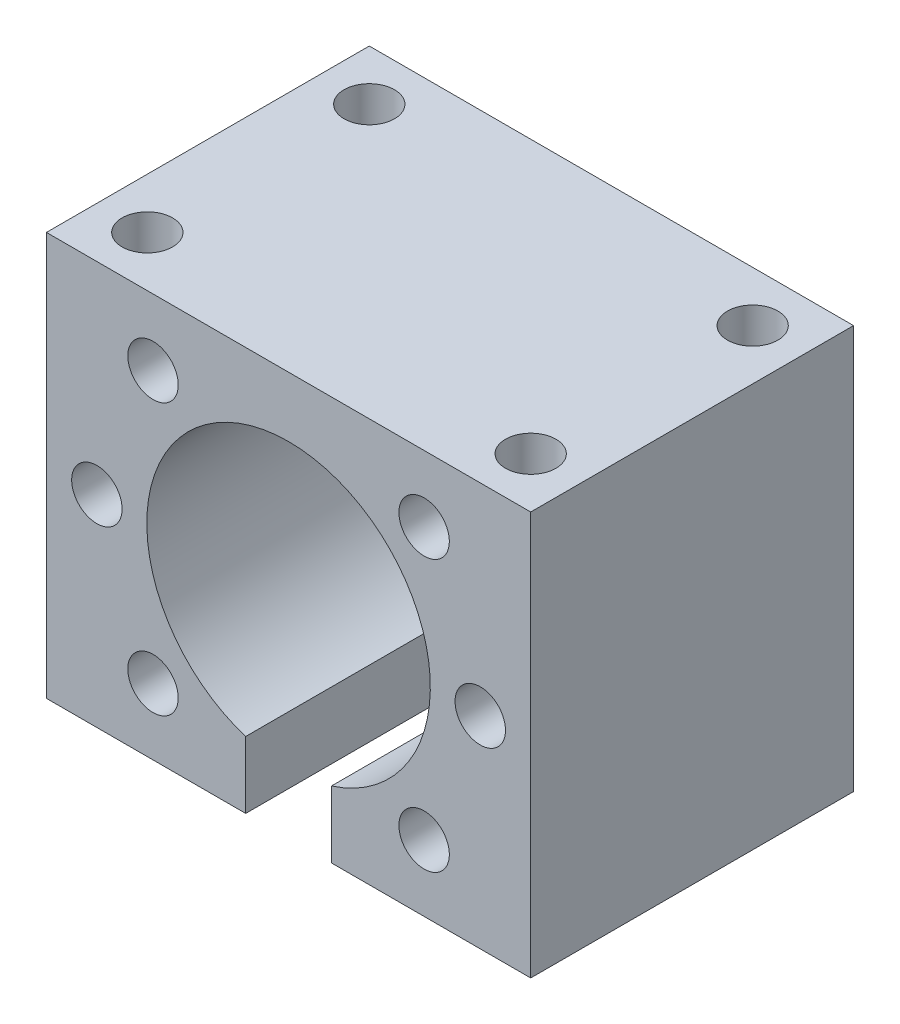
ISO-10303-21;
HEADER;
FILE_DESCRIPTION(('STEP AP214'),'2;1');
FILE_NAME('part.step','',(''),(''),'','','');
FILE_SCHEMA(('AUTOMOTIVE_DESIGN { 1 0 10303 214 1 1 1 1 }'));
ENDSEC;
DATA;
#1=APPLICATION_CONTEXT('core data for automotive mechanical design processes');
#2=APPLICATION_PROTOCOL_DEFINITION('international standard','automotive_design',2000,#1);
#3=PRODUCT_CONTEXT('',#1,'mechanical');
#4=PRODUCT('Part','Part','',(#3));
#5=PRODUCT_RELATED_PRODUCT_CATEGORY('part','',(#4));
#6=PRODUCT_DEFINITION_FORMATION('','',#4);
#7=PRODUCT_DEFINITION_CONTEXT('part definition',#1,'design');
#8=PRODUCT_DEFINITION('design','',#6,#7);
#9=PRODUCT_DEFINITION_SHAPE('','',#8);
#10=(LENGTH_UNIT() NAMED_UNIT(*) SI_UNIT(.MILLI.,.METRE.));
#11=(NAMED_UNIT(*) PLANE_ANGLE_UNIT() SI_UNIT($,.RADIAN.));
#12=(NAMED_UNIT(*) SI_UNIT($,.STERADIAN.) SOLID_ANGLE_UNIT());
#13=UNCERTAINTY_MEASURE_WITH_UNIT(LENGTH_MEASURE(1.E-05),#10,'distance_accuracy_value','');
#14=(GEOMETRIC_REPRESENTATION_CONTEXT(3) GLOBAL_UNCERTAINTY_ASSIGNED_CONTEXT((#13)) GLOBAL_UNIT_ASSIGNED_CONTEXT((#10,
#11,#12)) REPRESENTATION_CONTEXT('',''));
#15=CARTESIAN_POINT('',(0.,0.,0.));
#16=DIRECTION('',(0.,0.,1.));
#17=DIRECTION('',(1.,0.,0.));
#18=AXIS2_PLACEMENT_3D('',#15,#16,#17);
#19=CARTESIAN_POINT('',(-24.,40.,32.));
#20=DIRECTION('',(0.,-1.,0.));
#21=DIRECTION('',(0.,0.,-1.));
#22=AXIS2_PLACEMENT_3D('',#19,#20,#21);
#23=PLANE('',#22);
#24=CARTESIAN_POINT('',(-19.,40.,5.));
#25=DIRECTION('',(0.,1.,0.));
#26=DIRECTION('',(0.,0.,1.));
#27=AXIS2_PLACEMENT_3D('',#24,#25,#26);
#28=CIRCLE('',#27,2.49999999999999);
#29=CARTESIAN_POINT('',(-19.,40.,7.49999999999999));
#30=VERTEX_POINT('',#29);
#31=EDGE_CURVE('E143',#30,#30,#28,.T.);
#32=ORIENTED_EDGE('',*,*,#31,.F.);
#33=EDGE_LOOP('',(#32));
#34=FACE_BOUND('',#33,.T.);
#35=CARTESIAN_POINT('',(-19.,40.,27.));
#36=DIRECTION('',(0.,1.,0.));
#37=DIRECTION('',(0.,0.,1.));
#38=AXIS2_PLACEMENT_3D('',#35,#36,#37);
#39=CIRCLE('',#38,2.49999999999999);
#40=CARTESIAN_POINT('',(-19.,40.,29.5));
#41=VERTEX_POINT('',#40);
#42=EDGE_CURVE('E142',#41,#41,#39,.T.);
#43=ORIENTED_EDGE('',*,*,#42,.F.);
#44=EDGE_LOOP('',(#43));
#45=FACE_BOUND('',#44,.T.);
#46=CARTESIAN_POINT('',(19.,40.,27.));
#47=DIRECTION('',(0.,1.,0.));
#48=DIRECTION('',(0.,0.,1.));
#49=AXIS2_PLACEMENT_3D('',#46,#47,#48);
#50=CIRCLE('',#49,2.49999999999999);
#51=CARTESIAN_POINT('',(19.,40.,29.5));
#52=VERTEX_POINT('',#51);
#53=EDGE_CURVE('E146',#52,#52,#50,.T.);
#54=ORIENTED_EDGE('',*,*,#53,.F.);
#55=EDGE_LOOP('',(#54));
#56=FACE_BOUND('',#55,.T.);
#57=CARTESIAN_POINT('',(19.,40.,5.));
#58=DIRECTION('',(0.,1.,0.));
#59=DIRECTION('',(0.,0.,1.));
#60=AXIS2_PLACEMENT_3D('',#57,#58,#59);
#61=CIRCLE('',#60,2.49999999999999);
#62=CARTESIAN_POINT('',(19.,40.,7.49999999999999));
#63=VERTEX_POINT('',#62);
#64=EDGE_CURVE('E153',#63,#63,#61,.T.);
#65=ORIENTED_EDGE('',*,*,#64,.F.);
#66=EDGE_LOOP('',(#65));
#67=FACE_BOUND('',#66,.T.);
#68=DIRECTION('',(-1.,0.,0.));
#69=VECTOR('',#68,1.);
#70=CARTESIAN_POINT('',(-24.,40.,0.));
#71=LINE('',#70,#69);
#72=CARTESIAN_POINT('',(24.,40.,0.));
#73=VERTEX_POINT('',#72);
#74=CARTESIAN_POINT('',(-24.,40.,0.));
#75=VERTEX_POINT('',#74);
#76=EDGE_CURVE('E195',#73,#75,#71,.T.);
#77=ORIENTED_EDGE('',*,*,#76,.T.);
#78=DIRECTION('',(0.,0.,-1.));
#79=VECTOR('',#78,1.);
#80=CARTESIAN_POINT('',(-24.,40.,32.));
#81=LINE('',#80,#79);
#82=CARTESIAN_POINT('',(-24.,40.,32.));
#83=VERTEX_POINT('',#82);
#84=EDGE_CURVE('E250',#83,#75,#81,.T.);
#85=ORIENTED_EDGE('',*,*,#84,.F.);
#86=DIRECTION('',(-1.,0.,0.));
#87=VECTOR('',#86,1.);
#88=CARTESIAN_POINT('',(-24.,40.,32.));
#89=LINE('',#88,#87);
#90=CARTESIAN_POINT('',(24.,40.,32.));
#91=VERTEX_POINT('',#90);
#92=EDGE_CURVE('E196',#91,#83,#89,.T.);
#93=ORIENTED_EDGE('',*,*,#92,.F.);
#94=DIRECTION('',(0.,0.,-1.));
#95=VECTOR('',#94,1.);
#96=CARTESIAN_POINT('',(24.,40.,32.));
#97=LINE('',#96,#95);
#98=EDGE_CURVE('E214',#91,#73,#97,.T.);
#99=ORIENTED_EDGE('',*,*,#98,.T.);
#100=EDGE_LOOP('',(#77,#85,#93,#99));
#101=FACE_BOUND('',#100,.T.);
#102=ADVANCED_FACE('F36',(#34,#45,#56,#67,#101),#23,.F.);
#103=CARTESIAN_POINT('',(-24.,40.,32.));
#104=DIRECTION('',(1.,0.,0.));
#105=DIRECTION('',(0.,1.,0.));
#106=AXIS2_PLACEMENT_3D('',#103,#104,#105);
#107=PLANE('',#106);
#108=DIRECTION('',(0.,-1.,0.));
#109=VECTOR('',#108,1.);
#110=CARTESIAN_POINT('',(-24.,40.,0.));
#111=LINE('',#110,#109);
#112=CARTESIAN_POINT('',(-24.,0.,0.));
#113=VERTEX_POINT('',#112);
#114=EDGE_CURVE('E217',#75,#113,#111,.T.);
#115=ORIENTED_EDGE('',*,*,#114,.T.);
#116=DIRECTION('',(0.,0.,-1.));
#117=VECTOR('',#116,1.);
#118=CARTESIAN_POINT('',(-24.,0.,32.));
#119=LINE('',#118,#117);
#120=CARTESIAN_POINT('',(-24.,0.,32.));
#121=VERTEX_POINT('',#120);
#122=EDGE_CURVE('E247',#121,#113,#119,.T.);
#123=ORIENTED_EDGE('',*,*,#122,.F.);
#124=DIRECTION('',(0.,-1.,0.));
#125=VECTOR('',#124,1.);
#126=CARTESIAN_POINT('',(-24.,40.,32.));
#127=LINE('',#126,#125);
#128=EDGE_CURVE('E199',#83,#121,#127,.T.);
#129=ORIENTED_EDGE('',*,*,#128,.F.);
#130=ORIENTED_EDGE('',*,*,#84,.T.);
#131=EDGE_LOOP('',(#115,#123,#129,#130));
#132=FACE_BOUND('',#131,.T.);
#133=ADVANCED_FACE('F269',(#132),#107,.F.);
#134=CARTESIAN_POINT('',(-24.,0.,32.));
#135=DIRECTION('',(0.,1.,0.));
#136=DIRECTION('',(-1.,0.,0.));
#137=AXIS2_PLACEMENT_3D('',#134,#135,#136);
#138=PLANE('',#137);
#139=DIRECTION('',(1.,0.,0.));
#140=VECTOR('',#139,1.);
#141=CARTESIAN_POINT('',(-24.,0.,0.));
#142=LINE('',#141,#140);
#143=CARTESIAN_POINT('',(-4.25,0.,0.));
#144=VERTEX_POINT('',#143);
#145=EDGE_CURVE('E219',#113,#144,#142,.T.);
#146=ORIENTED_EDGE('',*,*,#145,.T.);
#147=DIRECTION('',(0.,0.,-1.));
#148=VECTOR('',#147,1.);
#149=CARTESIAN_POINT('',(-4.25,0.,32.));
#150=LINE('',#149,#148);
#151=CARTESIAN_POINT('',(-4.25,0.,32.));
#152=VERTEX_POINT('',#151);
#153=EDGE_CURVE('E244',#152,#144,#150,.T.);
#154=ORIENTED_EDGE('',*,*,#153,.F.);
#155=DIRECTION('',(1.,0.,0.));
#156=VECTOR('',#155,1.);
#157=CARTESIAN_POINT('',(-24.,0.,32.));
#158=LINE('',#157,#156);
#159=EDGE_CURVE('E202',#121,#152,#158,.T.);
#160=ORIENTED_EDGE('',*,*,#159,.F.);
#161=ORIENTED_EDGE('',*,*,#122,.T.);
#162=EDGE_LOOP('',(#146,#154,#160,#161));
#163=FACE_BOUND('',#162,.T.);
#164=ADVANCED_FACE('F274',(#163),#138,.F.);
#165=CARTESIAN_POINT('',(-4.25,0.,32.));
#166=DIRECTION('',(-1.,0.,0.));
#167=DIRECTION('',(0.,0.,1.));
#168=AXIS2_PLACEMENT_3D('',#165,#166,#167);
#169=PLANE('',#168);
#170=DIRECTION('',(0.,1.,0.));
#171=VECTOR('',#170,1.);
#172=CARTESIAN_POINT('',(-4.25,0.,0.));
#173=LINE('',#172,#171);
#174=CARTESIAN_POINT('',(-4.25,6.60821147120371,0.));
#175=VERTEX_POINT('',#174);
#176=EDGE_CURVE('E221',#144,#175,#173,.T.);
#177=ORIENTED_EDGE('',*,*,#176,.T.);
#178=DIRECTION('',(0.,0.,-1.));
#179=VECTOR('',#178,1.);
#180=CARTESIAN_POINT('',(-4.25,6.60821147120371,32.));
#181=LINE('',#180,#179);
#182=CARTESIAN_POINT('',(-4.25,6.60821147120371,32.));
#183=VERTEX_POINT('',#182);
#184=EDGE_CURVE('E241',#183,#175,#181,.T.);
#185=ORIENTED_EDGE('',*,*,#184,.F.);
#186=DIRECTION('',(0.,1.,0.));
#187=VECTOR('',#186,1.);
#188=CARTESIAN_POINT('',(-4.25,0.,32.));
#189=LINE('',#188,#187);
#190=EDGE_CURVE('E204',#152,#183,#189,.T.);
#191=ORIENTED_EDGE('',*,*,#190,.F.);
#192=ORIENTED_EDGE('',*,*,#153,.T.);
#193=EDGE_LOOP('',(#177,#185,#191,#192));
#194=FACE_BOUND('',#193,.T.);
#195=ADVANCED_FACE('F318',(#194),#169,.F.);
#196=CARTESIAN_POINT('',(0.,20.,32.));
#197=DIRECTION('',(0.,0.,-1.));
#198=DIRECTION('',(-1.,0.,0.));
#199=AXIS2_PLACEMENT_3D('',#196,#197,#198);
#200=CYLINDRICAL_SURFACE('',#199,14.05);
#201=CARTESIAN_POINT('',(0.,20.,0.));
#202=DIRECTION('',(0.,0.,-1.));
#203=DIRECTION('',(1.,0.,0.));
#204=AXIS2_PLACEMENT_3D('',#201,#202,#203);
#205=CIRCLE('',#204,14.05);
#206=CARTESIAN_POINT('',(4.25,6.60821147120371,0.));
#207=VERTEX_POINT('',#206);
#208=EDGE_CURVE('E223',#175,#207,#205,.T.);
#209=ORIENTED_EDGE('',*,*,#208,.T.);
#210=DIRECTION('',(0.,0.,-1.));
#211=VECTOR('',#210,1.);
#212=CARTESIAN_POINT('',(4.25,6.60821147120371,32.));
#213=LINE('',#212,#211);
#214=CARTESIAN_POINT('',(4.25,6.60821147120371,32.));
#215=VERTEX_POINT('',#214);
#216=EDGE_CURVE('E238',#215,#207,#213,.T.);
#217=ORIENTED_EDGE('',*,*,#216,.F.);
#218=CARTESIAN_POINT('',(0.,20.,32.));
#219=DIRECTION('',(0.,0.,-1.));
#220=DIRECTION('',(1.,0.,0.));
#221=AXIS2_PLACEMENT_3D('',#218,#219,#220);
#222=CIRCLE('',#221,14.05);
#223=EDGE_CURVE('E206',#183,#215,#222,.T.);
#224=ORIENTED_EDGE('',*,*,#223,.F.);
#225=ORIENTED_EDGE('',*,*,#184,.T.);
#226=EDGE_LOOP('',(#209,#217,#224,#225));
#227=FACE_BOUND('',#226,.T.);
#228=ADVANCED_FACE('F314',(#227),#200,.F.);
#229=CARTESIAN_POINT('',(4.25,0.,32.));
#230=DIRECTION('',(1.,0.,0.));
#231=DIRECTION('',(0.,0.,-1.));
#232=AXIS2_PLACEMENT_3D('',#229,#230,#231);
#233=PLANE('',#232);
#234=DIRECTION('',(0.,-1.,0.));
#235=VECTOR('',#234,1.);
#236=CARTESIAN_POINT('',(4.25,0.,0.));
#237=LINE('',#236,#235);
#238=CARTESIAN_POINT('',(4.25,0.,0.));
#239=VERTEX_POINT('',#238);
#240=EDGE_CURVE('E225',#207,#239,#237,.T.);
#241=ORIENTED_EDGE('',*,*,#240,.T.);
#242=DIRECTION('',(0.,0.,-1.));
#243=VECTOR('',#242,1.);
#244=CARTESIAN_POINT('',(4.25,0.,32.));
#245=LINE('',#244,#243);
#246=CARTESIAN_POINT('',(4.25,0.,32.));
#247=VERTEX_POINT('',#246);
#248=EDGE_CURVE('E235',#247,#239,#245,.T.);
#249=ORIENTED_EDGE('',*,*,#248,.F.);
#250=DIRECTION('',(0.,-1.,0.));
#251=VECTOR('',#250,1.);
#252=CARTESIAN_POINT('',(4.25,0.,32.));
#253=LINE('',#252,#251);
#254=EDGE_CURVE('E208',#215,#247,#253,.T.);
#255=ORIENTED_EDGE('',*,*,#254,.F.);
#256=ORIENTED_EDGE('',*,*,#216,.T.);
#257=EDGE_LOOP('',(#241,#249,#255,#256));
#258=FACE_BOUND('',#257,.T.);
#259=ADVANCED_FACE('F309',(#258),#233,.F.);
#260=CARTESIAN_POINT('',(24.,0.,32.));
#261=DIRECTION('',(0.,1.,0.));
#262=DIRECTION('',(-1.,0.,0.));
#263=AXIS2_PLACEMENT_3D('',#260,#261,#262);
#264=PLANE('',#263);
#265=DIRECTION('',(1.,0.,0.));
#266=VECTOR('',#265,1.);
#267=CARTESIAN_POINT('',(24.,0.,0.));
#268=LINE('',#267,#266);
#269=CARTESIAN_POINT('',(24.,0.,0.));
#270=VERTEX_POINT('',#269);
#271=EDGE_CURVE('E227',#239,#270,#268,.T.);
#272=ORIENTED_EDGE('',*,*,#271,.T.);
#273=DIRECTION('',(0.,0.,-1.));
#274=VECTOR('',#273,1.);
#275=CARTESIAN_POINT('',(24.,0.,32.));
#276=LINE('',#275,#274);
#277=CARTESIAN_POINT('',(24.,0.,32.));
#278=VERTEX_POINT('',#277);
#279=EDGE_CURVE('E232',#278,#270,#276,.T.);
#280=ORIENTED_EDGE('',*,*,#279,.F.);
#281=DIRECTION('',(1.,0.,0.));
#282=VECTOR('',#281,1.);
#283=CARTESIAN_POINT('',(24.,0.,32.));
#284=LINE('',#283,#282);
#285=EDGE_CURVE('E210',#247,#278,#284,.T.);
#286=ORIENTED_EDGE('',*,*,#285,.F.);
#287=ORIENTED_EDGE('',*,*,#248,.T.);
#288=EDGE_LOOP('',(#272,#280,#286,#287));
#289=FACE_BOUND('',#288,.T.);
#290=ADVANCED_FACE('F304',(#289),#264,.F.);
#291=CARTESIAN_POINT('',(24.,40.,32.));
#292=DIRECTION('',(-1.,0.,0.));
#293=DIRECTION('',(0.,-1.,0.));
#294=AXIS2_PLACEMENT_3D('',#291,#292,#293);
#295=PLANE('',#294);
#296=DIRECTION('',(0.,1.,0.));
#297=VECTOR('',#296,1.);
#298=CARTESIAN_POINT('',(24.,40.,0.));
#299=LINE('',#298,#297);
#300=EDGE_CURVE('E200',#270,#73,#299,.T.);
#301=ORIENTED_EDGE('',*,*,#300,.T.);
#302=ORIENTED_EDGE('',*,*,#98,.F.);
#303=DIRECTION('',(0.,1.,0.));
#304=VECTOR('',#303,1.);
#305=CARTESIAN_POINT('',(24.,40.,32.));
#306=LINE('',#305,#304);
#307=EDGE_CURVE('E212',#278,#91,#306,.T.);
#308=ORIENTED_EDGE('',*,*,#307,.F.);
#309=ORIENTED_EDGE('',*,*,#279,.T.);
#310=EDGE_LOOP('',(#301,#302,#308,#309));
#311=FACE_BOUND('',#310,.T.);
#312=ADVANCED_FACE('F302',(#311),#295,.F.);
#313=CARTESIAN_POINT('',(0.,20.,32.));
#314=DIRECTION('',(0.,0.,1.));
#315=DIRECTION('',(1.,0.,0.));
#316=AXIS2_PLACEMENT_3D('',#313,#314,#315);
#317=PLANE('',#316);
#318=CARTESIAN_POINT('',(-13.4350288425443,33.4350288425445,32.));
#319=DIRECTION('',(0.,0.,1.));
#320=DIRECTION('',(1.,0.,0.));
#321=AXIS2_PLACEMENT_3D('',#318,#319,#320);
#322=CIRCLE('',#321,2.49999999999999);
#323=CARTESIAN_POINT('',(-10.9350288425443,33.4350288425445,32.));
#324=VERTEX_POINT('',#323);
#325=EDGE_CURVE('E159',#324,#324,#322,.T.);
#326=ORIENTED_EDGE('',*,*,#325,.F.);
#327=EDGE_LOOP('',(#326));
#328=FACE_BOUND('',#327,.T.);
#329=CARTESIAN_POINT('',(-19.,20.,32.));
#330=DIRECTION('',(0.,0.,1.));
#331=DIRECTION('',(1.,0.,0.));
#332=AXIS2_PLACEMENT_3D('',#329,#330,#331);
#333=CIRCLE('',#332,2.49999999999999);
#334=CARTESIAN_POINT('',(-16.5,20.,32.));
#335=VERTEX_POINT('',#334);
#336=EDGE_CURVE('E165',#335,#335,#333,.T.);
#337=ORIENTED_EDGE('',*,*,#336,.F.);
#338=EDGE_LOOP('',(#337));
#339=FACE_BOUND('',#338,.T.);
#340=CARTESIAN_POINT('',(-13.4350288425443,6.56497115745553,32.));
#341=DIRECTION('',(0.,0.,1.));
#342=DIRECTION('',(1.,0.,0.));
#343=AXIS2_PLACEMENT_3D('',#340,#341,#342);
#344=CIRCLE('',#343,2.49999999999999);
#345=CARTESIAN_POINT('',(-10.9350288425443,6.56497115745553,32.));
#346=VERTEX_POINT('',#345);
#347=EDGE_CURVE('E171',#346,#346,#344,.T.);
#348=ORIENTED_EDGE('',*,*,#347,.F.);
#349=EDGE_LOOP('',(#348));
#350=FACE_BOUND('',#349,.T.);
#351=CARTESIAN_POINT('',(13.4350288425443,6.56497115745553,32.));
#352=DIRECTION('',(0.,0.,1.));
#353=DIRECTION('',(1.,0.,0.));
#354=AXIS2_PLACEMENT_3D('',#351,#352,#353);
#355=CIRCLE('',#354,2.49999999999999);
#356=CARTESIAN_POINT('',(15.9350288425443,6.56497115745553,32.));
#357=VERTEX_POINT('',#356);
#358=EDGE_CURVE('E177',#357,#357,#355,.T.);
#359=ORIENTED_EDGE('',*,*,#358,.F.);
#360=EDGE_LOOP('',(#359));
#361=FACE_BOUND('',#360,.T.);
#362=CARTESIAN_POINT('',(19.,20.,32.));
#363=DIRECTION('',(0.,0.,1.));
#364=DIRECTION('',(1.,0.,0.));
#365=AXIS2_PLACEMENT_3D('',#362,#363,#364);
#366=CIRCLE('',#365,2.49999999999999);
#367=CARTESIAN_POINT('',(21.5,20.,32.));
#368=VERTEX_POINT('',#367);
#369=EDGE_CURVE('E183',#368,#368,#366,.T.);
#370=ORIENTED_EDGE('',*,*,#369,.F.);
#371=EDGE_LOOP('',(#370));
#372=FACE_BOUND('',#371,.T.);
#373=CARTESIAN_POINT('',(13.4350288425443,33.4350288425445,32.));
#374=DIRECTION('',(0.,0.,1.));
#375=DIRECTION('',(1.,0.,0.));
#376=AXIS2_PLACEMENT_3D('',#373,#374,#375);
#377=CIRCLE('',#376,2.49999999999999);
#378=CARTESIAN_POINT('',(15.9350288425443,33.4350288425445,32.));
#379=VERTEX_POINT('',#378);
#380=EDGE_CURVE('E189',#379,#379,#377,.T.);
#381=ORIENTED_EDGE('',*,*,#380,.F.);
#382=EDGE_LOOP('',(#381));
#383=FACE_BOUND('',#382,.T.);
#384=ORIENTED_EDGE('',*,*,#92,.T.);
#385=ORIENTED_EDGE('',*,*,#128,.T.);
#386=ORIENTED_EDGE('',*,*,#159,.T.);
#387=ORIENTED_EDGE('',*,*,#190,.T.);
#388=ORIENTED_EDGE('',*,*,#223,.T.);
#389=ORIENTED_EDGE('',*,*,#254,.T.);
#390=ORIENTED_EDGE('',*,*,#285,.T.);
#391=ORIENTED_EDGE('',*,*,#307,.T.);
#392=EDGE_LOOP('',(#384,#385,#386,#387,#388,#389,#390,#391));
#393=FACE_BOUND('',#392,.T.);
#394=ADVANCED_FACE('F297',(#328,#339,#350,#361,#372,#383,#393),#317,.T.);
#395=CARTESIAN_POINT('',(0.,20.,0.));
#396=DIRECTION('',(0.,0.,1.));
#397=DIRECTION('',(1.,0.,0.));
#398=AXIS2_PLACEMENT_3D('',#395,#396,#397);
#399=PLANE('',#398);
#400=ORIENTED_EDGE('',*,*,#76,.F.);
#401=ORIENTED_EDGE('',*,*,#300,.F.);
#402=ORIENTED_EDGE('',*,*,#271,.F.);
#403=ORIENTED_EDGE('',*,*,#240,.F.);
#404=ORIENTED_EDGE('',*,*,#208,.F.);
#405=ORIENTED_EDGE('',*,*,#176,.F.);
#406=ORIENTED_EDGE('',*,*,#145,.F.);
#407=ORIENTED_EDGE('',*,*,#114,.F.);
#408=EDGE_LOOP('',(#400,#401,#402,#403,#404,#405,#406,#407));
#409=FACE_BOUND('',#408,.T.);
#410=ADVANCED_FACE('F290',(#409),#399,.F.);
#411=CARTESIAN_POINT('',(13.4350288425443,33.4350288425445,12.));
#412=DIRECTION('',(0.,0.,1.));
#413=DIRECTION('',(1.,0.,0.));
#414=AXIS2_PLACEMENT_3D('',#411,#412,#413);
#415=CONICAL_SURFACE('',#414,2.49999999999998,1.02974425867665);
#416=CARTESIAN_POINT('',(13.4350288425443,33.4350288425445,10.4978484524311));
#417=VERTEX_POINT('',#416);
#418=VERTEX_LOOP('',#417);
#419=FACE_BOUND('',#418,.T.);
#420=CARTESIAN_POINT('',(13.4350288425443,33.4350288425445,12.));
#421=DIRECTION('',(0.,0.,1.));
#422=DIRECTION('',(1.,0.,0.));
#423=AXIS2_PLACEMENT_3D('',#420,#421,#422);
#424=CIRCLE('',#423,2.49999999999998);
#425=CARTESIAN_POINT('',(15.9350288425443,33.4350288425445,12.));
#426=VERTEX_POINT('',#425);
#427=EDGE_CURVE('E192',#426,#426,#424,.T.);
#428=ORIENTED_EDGE('',*,*,#427,.T.);
#429=EDGE_LOOP('',(#428));
#430=FACE_BOUND('',#429,.T.);
#431=ADVANCED_FACE('F338',(#419,#430),#415,.F.);
#432=CARTESIAN_POINT('',(13.4350288425443,33.4350288425445,32.));
#433=DIRECTION('',(0.,0.,1.));
#434=DIRECTION('',(1.,0.,0.));
#435=AXIS2_PLACEMENT_3D('',#432,#433,#434);
#436=CYLINDRICAL_SURFACE('',#435,2.49999999999999);
#437=ORIENTED_EDGE('',*,*,#427,.F.);
#438=EDGE_LOOP('',(#437));
#439=FACE_BOUND('',#438,.T.);
#440=ORIENTED_EDGE('',*,*,#380,.T.);
#441=EDGE_LOOP('',(#440));
#442=FACE_BOUND('',#441,.T.);
#443=ADVANCED_FACE('F344',(#439,#442),#436,.F.);
#444=CARTESIAN_POINT('',(19.,20.,12.));
#445=DIRECTION('',(0.,0.,1.));
#446=DIRECTION('',(1.,0.,0.));
#447=AXIS2_PLACEMENT_3D('',#444,#445,#446);
#448=CONICAL_SURFACE('',#447,2.49999999999998,1.02974425867665);
#449=CARTESIAN_POINT('',(19.,20.,10.4978484524311));
#450=VERTEX_POINT('',#449);
#451=VERTEX_LOOP('',#450);
#452=FACE_BOUND('',#451,.T.);
#453=CARTESIAN_POINT('',(19.,20.,12.));
#454=DIRECTION('',(0.,0.,1.));
#455=DIRECTION('',(1.,0.,0.));
#456=AXIS2_PLACEMENT_3D('',#453,#454,#455);
#457=CIRCLE('',#456,2.49999999999998);
#458=CARTESIAN_POINT('',(21.5,20.,12.));
#459=VERTEX_POINT('',#458);
#460=EDGE_CURVE('E186',#459,#459,#457,.T.);
#461=ORIENTED_EDGE('',*,*,#460,.T.);
#462=EDGE_LOOP('',(#461));
#463=FACE_BOUND('',#462,.T.);
#464=ADVANCED_FACE('F348',(#452,#463),#448,.F.);
#465=CARTESIAN_POINT('',(19.,20.,32.));
#466=DIRECTION('',(0.,0.,1.));
#467=DIRECTION('',(1.,0.,0.));
#468=AXIS2_PLACEMENT_3D('',#465,#466,#467);
#469=CYLINDRICAL_SURFACE('',#468,2.49999999999999);
#470=CARTESIAN_POINT('',(19.,20.,27.));
#471=DIRECTION('',(0.,-0.707106781186547,0.707106781186547));
#472=DIRECTION('',(0.,0.707106781186547,0.707106781186547));
#473=AXIS2_PLACEMENT_3D('',#470,#471,#472);
#474=ELLIPSE('',#473,3.53553390593272,2.49999999999999);
#475=CARTESIAN_POINT('',(16.5,20.,27.));
#476=VERTEX_POINT('',#475);
#477=CARTESIAN_POINT('',(21.5,20.,27.));
#478=VERTEX_POINT('',#477);
#479=EDGE_CURVE('E253',#476,#478,#474,.F.);
#480=ORIENTED_EDGE('',*,*,#479,.T.);
#481=CARTESIAN_POINT('',(19.,20.,27.));
#482=DIRECTION('',(0.,0.707106781186547,0.707106781186547));
#483=DIRECTION('',(0.,-0.707106781186547,0.707106781186547));
#484=AXIS2_PLACEMENT_3D('',#481,#482,#483);
#485=ELLIPSE('',#484,3.53553390593272,2.49999999999999);
#486=EDGE_CURVE('E54',#478,#476,#485,.T.);
#487=ORIENTED_EDGE('',*,*,#486,.T.);
#488=EDGE_LOOP('',(#480,#487));
#489=FACE_BOUND('',#488,.T.);
#490=ORIENTED_EDGE('',*,*,#460,.F.);
#491=EDGE_LOOP('',(#490));
#492=FACE_BOUND('',#491,.T.);
#493=ORIENTED_EDGE('',*,*,#369,.T.);
#494=EDGE_LOOP('',(#493));
#495=FACE_BOUND('',#494,.T.);
#496=ADVANCED_FACE('F352',(#489,#492,#495),#469,.F.);
#497=CARTESIAN_POINT('',(13.4350288425443,6.56497115745553,12.));
#498=DIRECTION('',(0.,0.,1.));
#499=DIRECTION('',(1.,0.,0.));
#500=AXIS2_PLACEMENT_3D('',#497,#498,#499);
#501=CONICAL_SURFACE('',#500,2.49999999999999,1.02974425867665);
#502=CARTESIAN_POINT('',(13.4350288425443,6.56497115745553,10.4978484524311));
#503=VERTEX_POINT('',#502);
#504=VERTEX_LOOP('',#503);
#505=FACE_BOUND('',#504,.T.);
#506=CARTESIAN_POINT('',(13.4350288425443,6.56497115745553,12.));
#507=DIRECTION('',(0.,0.,1.));
#508=DIRECTION('',(1.,0.,0.));
#509=AXIS2_PLACEMENT_3D('',#506,#507,#508);
#510=CIRCLE('',#509,2.49999999999999);
#511=CARTESIAN_POINT('',(15.9350288425443,6.56497115745553,12.));
#512=VERTEX_POINT('',#511);
#513=EDGE_CURVE('E180',#512,#512,#510,.T.);
#514=ORIENTED_EDGE('',*,*,#513,.T.);
#515=EDGE_LOOP('',(#514));
#516=FACE_BOUND('',#515,.T.);
#517=ADVANCED_FACE('F356',(#505,#516),#501,.F.);
#518=CARTESIAN_POINT('',(13.4350288425443,6.56497115745553,32.));
#519=DIRECTION('',(0.,0.,1.));
#520=DIRECTION('',(1.,0.,0.));
#521=AXIS2_PLACEMENT_3D('',#518,#519,#520);
#522=CYLINDRICAL_SURFACE('',#521,2.49999999999999);
#523=ORIENTED_EDGE('',*,*,#513,.F.);
#524=EDGE_LOOP('',(#523));
#525=FACE_BOUND('',#524,.T.);
#526=ORIENTED_EDGE('',*,*,#358,.T.);
#527=EDGE_LOOP('',(#526));
#528=FACE_BOUND('',#527,.T.);
#529=ADVANCED_FACE('F360',(#525,#528),#522,.F.);
#530=CARTESIAN_POINT('',(-13.4350288425443,6.56497115745553,12.));
#531=DIRECTION('',(0.,0.,1.));
#532=DIRECTION('',(1.,0.,0.));
#533=AXIS2_PLACEMENT_3D('',#530,#531,#532);
#534=CONICAL_SURFACE('',#533,2.49999999999999,1.02974425867665);
#535=CARTESIAN_POINT('',(-13.4350288425443,6.56497115745553,10.4978484524311));
#536=VERTEX_POINT('',#535);
#537=VERTEX_LOOP('',#536);
#538=FACE_BOUND('',#537,.T.);
#539=CARTESIAN_POINT('',(-13.4350288425443,6.56497115745553,12.));
#540=DIRECTION('',(0.,0.,1.));
#541=DIRECTION('',(1.,0.,0.));
#542=AXIS2_PLACEMENT_3D('',#539,#540,#541);
#543=CIRCLE('',#542,2.49999999999999);
#544=CARTESIAN_POINT('',(-10.9350288425443,6.56497115745553,12.));
#545=VERTEX_POINT('',#544);
#546=EDGE_CURVE('E174',#545,#545,#543,.T.);
#547=ORIENTED_EDGE('',*,*,#546,.T.);
#548=EDGE_LOOP('',(#547));
#549=FACE_BOUND('',#548,.T.);
#550=ADVANCED_FACE('F364',(#538,#549),#534,.F.);
#551=CARTESIAN_POINT('',(-13.4350288425443,6.56497115745553,32.));
#552=DIRECTION('',(0.,0.,1.));
#553=DIRECTION('',(1.,0.,0.));
#554=AXIS2_PLACEMENT_3D('',#551,#552,#553);
#555=CYLINDRICAL_SURFACE('',#554,2.49999999999999);
#556=ORIENTED_EDGE('',*,*,#546,.F.);
#557=EDGE_LOOP('',(#556));
#558=FACE_BOUND('',#557,.T.);
#559=ORIENTED_EDGE('',*,*,#347,.T.);
#560=EDGE_LOOP('',(#559));
#561=FACE_BOUND('',#560,.T.);
#562=ADVANCED_FACE('F368',(#558,#561),#555,.F.);
#563=CARTESIAN_POINT('',(-19.,20.,12.));
#564=DIRECTION('',(0.,0.,1.));
#565=DIRECTION('',(1.,0.,0.));
#566=AXIS2_PLACEMENT_3D('',#563,#564,#565);
#567=CONICAL_SURFACE('',#566,2.49999999999998,1.02974425867665);
#568=CARTESIAN_POINT('',(-19.,20.,10.4978484524311));
#569=VERTEX_POINT('',#568);
#570=VERTEX_LOOP('',#569);
#571=FACE_BOUND('',#570,.T.);
#572=CARTESIAN_POINT('',(-19.,20.,12.));
#573=DIRECTION('',(0.,0.,1.));
#574=DIRECTION('',(1.,0.,0.));
#575=AXIS2_PLACEMENT_3D('',#572,#573,#574);
#576=CIRCLE('',#575,2.49999999999998);
#577=CARTESIAN_POINT('',(-16.5,20.,12.));
#578=VERTEX_POINT('',#577);
#579=EDGE_CURVE('E168',#578,#578,#576,.T.);
#580=ORIENTED_EDGE('',*,*,#579,.T.);
#581=EDGE_LOOP('',(#580));
#582=FACE_BOUND('',#581,.T.);
#583=ADVANCED_FACE('F372',(#571,#582),#567,.F.);
#584=CARTESIAN_POINT('',(-19.,20.,32.));
#585=DIRECTION('',(0.,0.,1.));
#586=DIRECTION('',(1.,0.,0.));
#587=AXIS2_PLACEMENT_3D('',#584,#585,#586);
#588=CYLINDRICAL_SURFACE('',#587,2.49999999999999);
#589=CARTESIAN_POINT('',(-19.,20.,27.));
#590=DIRECTION('',(0.,-0.707106781186547,0.707106781186547));
#591=DIRECTION('',(0.,0.707106781186547,0.707106781186547));
#592=AXIS2_PLACEMENT_3D('',#589,#590,#591);
#593=ELLIPSE('',#592,3.53553390593272,2.49999999999999);
#594=CARTESIAN_POINT('',(-21.5,20.,27.));
#595=VERTEX_POINT('',#594);
#596=CARTESIAN_POINT('',(-16.5,20.,27.));
#597=VERTEX_POINT('',#596);
#598=EDGE_CURVE('E43',#595,#597,#593,.F.);
#599=ORIENTED_EDGE('',*,*,#598,.T.);
#600=CARTESIAN_POINT('',(-19.,20.,27.));
#601=DIRECTION('',(0.,0.707106781186547,0.707106781186547));
#602=DIRECTION('',(0.,-0.707106781186547,0.707106781186547));
#603=AXIS2_PLACEMENT_3D('',#600,#601,#602);
#604=ELLIPSE('',#603,3.53553390593272,2.49999999999999);
#605=EDGE_CURVE('E11',#597,#595,#604,.T.);
#606=ORIENTED_EDGE('',*,*,#605,.T.);
#607=EDGE_LOOP('',(#599,#606));
#608=FACE_BOUND('',#607,.T.);
#609=ORIENTED_EDGE('',*,*,#579,.F.);
#610=EDGE_LOOP('',(#609));
#611=FACE_BOUND('',#610,.T.);
#612=ORIENTED_EDGE('',*,*,#336,.T.);
#613=EDGE_LOOP('',(#612));
#614=FACE_BOUND('',#613,.T.);
#615=ADVANCED_FACE('F256',(#608,#611,#614),#588,.F.);
#616=CARTESIAN_POINT('',(-13.4350288425443,33.4350288425445,12.));
#617=DIRECTION('',(0.,0.,1.));
#618=DIRECTION('',(1.,0.,0.));
#619=AXIS2_PLACEMENT_3D('',#616,#617,#618);
#620=CONICAL_SURFACE('',#619,2.49999999999999,1.02974425867665);
#621=CARTESIAN_POINT('',(-13.4350288425443,33.4350288425445,10.4978484524311));
#622=VERTEX_POINT('',#621);
#623=VERTEX_LOOP('',#622);
#624=FACE_BOUND('',#623,.T.);
#625=CARTESIAN_POINT('',(-13.4350288425443,33.4350288425445,12.));
#626=DIRECTION('',(0.,0.,1.));
#627=DIRECTION('',(1.,0.,0.));
#628=AXIS2_PLACEMENT_3D('',#625,#626,#627);
#629=CIRCLE('',#628,2.49999999999999);
#630=CARTESIAN_POINT('',(-10.9350288425443,33.4350288425445,12.));
#631=VERTEX_POINT('',#630);
#632=EDGE_CURVE('E162',#631,#631,#629,.T.);
#633=ORIENTED_EDGE('',*,*,#632,.T.);
#634=EDGE_LOOP('',(#633));
#635=FACE_BOUND('',#634,.T.);
#636=ADVANCED_FACE('F379',(#624,#635),#620,.F.);
#637=CARTESIAN_POINT('',(-13.4350288425443,33.4350288425445,32.));
#638=DIRECTION('',(0.,0.,1.));
#639=DIRECTION('',(1.,0.,0.));
#640=AXIS2_PLACEMENT_3D('',#637,#638,#639);
#641=CYLINDRICAL_SURFACE('',#640,2.49999999999999);
#642=ORIENTED_EDGE('',*,*,#632,.F.);
#643=EDGE_LOOP('',(#642));
#644=FACE_BOUND('',#643,.T.);
#645=ORIENTED_EDGE('',*,*,#325,.T.);
#646=EDGE_LOOP('',(#645));
#647=FACE_BOUND('',#646,.T.);
#648=ADVANCED_FACE('F382',(#644,#647),#641,.F.);
#649=CARTESIAN_POINT('',(19.,20.,5.));
#650=DIRECTION('',(0.,1.,0.));
#651=DIRECTION('',(0.,0.,1.));
#652=AXIS2_PLACEMENT_3D('',#649,#650,#651);
#653=CONICAL_SURFACE('',#652,2.49999999999998,1.02974425867665);
#654=CARTESIAN_POINT('',(19.,18.4978484524311,5.));
#655=VERTEX_POINT('',#654);
#656=VERTEX_LOOP('',#655);
#657=FACE_BOUND('',#656,.T.);
#658=CARTESIAN_POINT('',(19.,20.,5.));
#659=DIRECTION('',(0.,1.,0.));
#660=DIRECTION('',(0.,0.,1.));
#661=AXIS2_PLACEMENT_3D('',#658,#659,#660);
#662=CIRCLE('',#661,2.49999999999998);
#663=CARTESIAN_POINT('',(19.,20.,7.49999999999999));
#664=VERTEX_POINT('',#663);
#665=EDGE_CURVE('E156',#664,#664,#662,.T.);
#666=ORIENTED_EDGE('',*,*,#665,.T.);
#667=EDGE_LOOP('',(#666));
#668=FACE_BOUND('',#667,.T.);
#669=ADVANCED_FACE('F386',(#657,#668),#653,.F.);
#670=CARTESIAN_POINT('',(19.,40.,5.));
#671=DIRECTION('',(0.,1.,0.));
#672=DIRECTION('',(0.,0.,1.));
#673=AXIS2_PLACEMENT_3D('',#670,#671,#672);
#674=CYLINDRICAL_SURFACE('',#673,2.49999999999999);
#675=ORIENTED_EDGE('',*,*,#665,.F.);
#676=EDGE_LOOP('',(#675));
#677=FACE_BOUND('',#676,.T.);
#678=ORIENTED_EDGE('',*,*,#64,.T.);
#679=EDGE_LOOP('',(#678));
#680=FACE_BOUND('',#679,.T.);
#681=ADVANCED_FACE('F265',(#677,#680),#674,.F.);
#682=CARTESIAN_POINT('',(19.,40.,27.));
#683=DIRECTION('',(0.,1.,0.));
#684=DIRECTION('',(0.,0.,1.));
#685=AXIS2_PLACEMENT_3D('',#682,#683,#684);
#686=CYLINDRICAL_SURFACE('',#685,2.49999999999999);
#687=ORIENTED_EDGE('',*,*,#53,.T.);
#688=EDGE_LOOP('',(#687));
#689=FACE_BOUND('',#688,.T.);
#690=ORIENTED_EDGE('',*,*,#479,.F.);
#691=ORIENTED_EDGE('',*,*,#486,.F.);
#692=EDGE_LOOP('',(#690,#691));
#693=FACE_BOUND('',#692,.T.);
#694=ADVANCED_FACE('F259',(#689,#693),#686,.F.);
#695=CARTESIAN_POINT('',(-19.,40.,27.));
#696=DIRECTION('',(0.,1.,0.));
#697=DIRECTION('',(0.,0.,1.));
#698=AXIS2_PLACEMENT_3D('',#695,#696,#697);
#699=CYLINDRICAL_SURFACE('',#698,2.49999999999999);
#700=ORIENTED_EDGE('',*,*,#42,.T.);
#701=EDGE_LOOP('',(#700));
#702=FACE_BOUND('',#701,.T.);
#703=ORIENTED_EDGE('',*,*,#598,.F.);
#704=ORIENTED_EDGE('',*,*,#605,.F.);
#705=EDGE_LOOP('',(#703,#704));
#706=FACE_BOUND('',#705,.T.);
#707=ADVANCED_FACE('F136',(#702,#706),#699,.F.);
#708=CARTESIAN_POINT('',(-19.,20.,5.));
#709=DIRECTION('',(0.,1.,0.));
#710=DIRECTION('',(0.,0.,1.));
#711=AXIS2_PLACEMENT_3D('',#708,#709,#710);
#712=CONICAL_SURFACE('',#711,2.49999999999998,1.02974425867665);
#713=CARTESIAN_POINT('',(-19.,18.4978484524311,5.));
#714=VERTEX_POINT('',#713);
#715=VERTEX_LOOP('',#714);
#716=FACE_BOUND('',#715,.T.);
#717=CARTESIAN_POINT('',(-19.,20.,5.));
#718=DIRECTION('',(0.,1.,0.));
#719=DIRECTION('',(0.,0.,1.));
#720=AXIS2_PLACEMENT_3D('',#717,#718,#719);
#721=CIRCLE('',#720,2.49999999999998);
#722=CARTESIAN_POINT('',(-19.,20.,7.49999999999999));
#723=VERTEX_POINT('',#722);
#724=EDGE_CURVE('E140',#723,#723,#721,.T.);
#725=ORIENTED_EDGE('',*,*,#724,.T.);
#726=EDGE_LOOP('',(#725));
#727=FACE_BOUND('',#726,.T.);
#728=ADVANCED_FACE('F132',(#716,#727),#712,.F.);
#729=CARTESIAN_POINT('',(-19.,40.,5.));
#730=DIRECTION('',(0.,1.,0.));
#731=DIRECTION('',(0.,0.,1.));
#732=AXIS2_PLACEMENT_3D('',#729,#730,#731);
#733=CYLINDRICAL_SURFACE('',#732,2.49999999999999);
#734=ORIENTED_EDGE('',*,*,#724,.F.);
#735=EDGE_LOOP('',(#734));
#736=FACE_BOUND('',#735,.T.);
#737=ORIENTED_EDGE('',*,*,#31,.T.);
#738=EDGE_LOOP('',(#737));
#739=FACE_BOUND('',#738,.T.);
#740=ADVANCED_FACE('F135',(#736,#739),#733,.F.);
#741=CLOSED_SHELL('',(#102,#133,#164,#195,#228,#259,#290,#312,#394,#410,#431,#443,#464,#496,
#517,#529,#550,#562,#583,#615,#636,#648,#669,#681,#694,#707,#728,#740));
#742=MANIFOLD_SOLID_BREP('B2',#741);
#743=ADVANCED_BREP_SHAPE_REPRESENTATION('',(#18,#742),#14);
#744=SHAPE_DEFINITION_REPRESENTATION(#9,#743);
ENDSEC;
END-ISO-10303-21;
